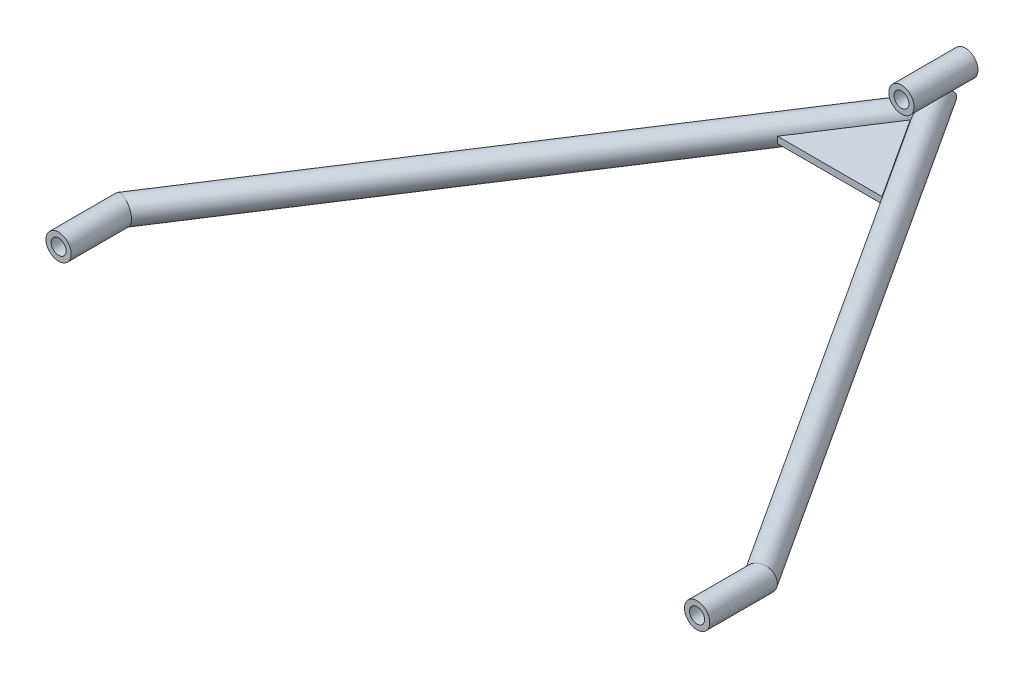
ISO-10303-21;
HEADER;
FILE_DESCRIPTION(('STEP AP214'),'2;1');
FILE_NAME('part.step','',(''),(''),'','','');
FILE_SCHEMA(('AUTOMOTIVE_DESIGN { 1 0 10303 214 1 1 1 1 }'));
ENDSEC;
DATA;
#1=APPLICATION_CONTEXT('core data for automotive mechanical design processes');
#2=APPLICATION_PROTOCOL_DEFINITION('international standard','automotive_design',2000,#1);
#3=PRODUCT_CONTEXT('',#1,'mechanical');
#4=PRODUCT('Part','Part','',(#3));
#5=PRODUCT_RELATED_PRODUCT_CATEGORY('part','',(#4));
#6=PRODUCT_DEFINITION_FORMATION('','',#4);
#7=PRODUCT_DEFINITION_CONTEXT('part definition',#1,'design');
#8=PRODUCT_DEFINITION('design','',#6,#7);
#9=PRODUCT_DEFINITION_SHAPE('','',#8);
#10=(LENGTH_UNIT() NAMED_UNIT(*) SI_UNIT(.MILLI.,.METRE.));
#11=(NAMED_UNIT(*) PLANE_ANGLE_UNIT() SI_UNIT($,.RADIAN.));
#12=(NAMED_UNIT(*) SI_UNIT($,.STERADIAN.) SOLID_ANGLE_UNIT());
#13=UNCERTAINTY_MEASURE_WITH_UNIT(LENGTH_MEASURE(1.E-05),#10,'distance_accuracy_value','');
#14=(GEOMETRIC_REPRESENTATION_CONTEXT(3) GLOBAL_UNCERTAINTY_ASSIGNED_CONTEXT((#13)) GLOBAL_UNIT_ASSIGNED_CONTEXT((#10,
#11,#12)) REPRESENTATION_CONTEXT('',''));
#15=CARTESIAN_POINT('',(0.,0.,0.));
#16=DIRECTION('',(0.,0.,1.));
#17=DIRECTION('',(1.,0.,0.));
#18=AXIS2_PLACEMENT_3D('',#15,#16,#17);
#19=CARTESIAN_POINT('',(0.,15.8,20.));
#20=DIRECTION('',(0.,0.,-1.));
#21=DIRECTION('',(-1.,0.,0.));
#22=AXIS2_PLACEMENT_3D('',#19,#20,#21);
#23=CYLINDRICAL_SURFACE('',#22,4.7);
#24=CARTESIAN_POINT('',(0.,15.8,20.));
#25=DIRECTION('',(0.,0.,1.));
#26=DIRECTION('',(1.,0.,0.));
#27=AXIS2_PLACEMENT_3D('',#24,#25,#26);
#28=CIRCLE('',#27,4.7);
#29=CARTESIAN_POINT('',(4.7,15.8,20.));
#30=VERTEX_POINT('',#29);
#31=EDGE_CURVE('E55',#30,#30,#28,.T.);
#32=ORIENTED_EDGE('',*,*,#31,.T.);
#33=EDGE_LOOP('',(#32));
#34=FACE_BOUND('',#33,.T.);
#35=CARTESIAN_POINT('',(0.,15.8,-20.));
#36=DIRECTION('',(0.,0.,1.));
#37=DIRECTION('',(1.,0.,0.));
#38=AXIS2_PLACEMENT_3D('',#35,#36,#37);
#39=CIRCLE('',#38,4.7);
#40=CARTESIAN_POINT('',(4.7,15.8,-20.));
#41=VERTEX_POINT('',#40);
#42=EDGE_CURVE('E61',#41,#41,#39,.T.);
#43=ORIENTED_EDGE('',*,*,#42,.F.);
#44=EDGE_LOOP('',(#43));
#45=FACE_BOUND('',#44,.T.);
#46=ADVANCED_FACE('F48',(#34,#45),#23,.F.);
#47=CARTESIAN_POINT('',(0.,15.8,20.));
#48=DIRECTION('',(0.,0.,-1.));
#49=DIRECTION('',(-1.,0.,0.));
#50=AXIS2_PLACEMENT_3D('',#47,#48,#49);
#51=CYLINDRICAL_SURFACE('',#50,7.9);
#52=CARTESIAN_POINT('',(0.,15.8,20.));
#53=DIRECTION('',(0.,0.,1.));
#54=DIRECTION('',(1.,0.,0.));
#55=AXIS2_PLACEMENT_3D('',#52,#53,#54);
#56=CIRCLE('',#55,7.9);
#57=CARTESIAN_POINT('',(7.9,15.8,20.));
#58=VERTEX_POINT('',#57);
#59=EDGE_CURVE('E11',#58,#58,#56,.T.);
#60=ORIENTED_EDGE('',*,*,#59,.F.);
#61=EDGE_LOOP('',(#60));
#62=FACE_BOUND('',#61,.T.);
#63=CARTESIAN_POINT('',(0.,15.8,-20.));
#64=DIRECTION('',(0.,0.,1.));
#65=DIRECTION('',(1.,0.,0.));
#66=AXIS2_PLACEMENT_3D('',#63,#64,#65);
#67=CIRCLE('',#66,7.9);
#68=CARTESIAN_POINT('',(7.9,15.8,-20.));
#69=VERTEX_POINT('',#68);
#70=EDGE_CURVE('E51',#69,#69,#67,.T.);
#71=ORIENTED_EDGE('',*,*,#70,.T.);
#72=EDGE_LOOP('',(#71));
#73=FACE_BOUND('',#72,.T.);
#74=ADVANCED_FACE('F68',(#62,#73),#51,.T.);
#75=CARTESIAN_POINT('',(0.,0.,20.));
#76=DIRECTION('',(0.,0.,1.));
#77=DIRECTION('',(1.,0.,0.));
#78=AXIS2_PLACEMENT_3D('',#75,#76,#77);
#79=PLANE('',#78);
#80=ORIENTED_EDGE('',*,*,#31,.F.);
#81=EDGE_LOOP('',(#80));
#82=FACE_BOUND('',#81,.T.);
#83=ORIENTED_EDGE('',*,*,#59,.T.);
#84=EDGE_LOOP('',(#83));
#85=FACE_BOUND('',#84,.T.);
#86=ADVANCED_FACE('F72',(#82,#85),#79,.T.);
#87=CARTESIAN_POINT('',(0.,0.,-20.));
#88=DIRECTION('',(0.,0.,1.));
#89=DIRECTION('',(1.,0.,0.));
#90=AXIS2_PLACEMENT_3D('',#87,#88,#89);
#91=PLANE('',#90);
#92=ORIENTED_EDGE('',*,*,#42,.T.);
#93=EDGE_LOOP('',(#92));
#94=FACE_BOUND('',#93,.T.);
#95=ORIENTED_EDGE('',*,*,#70,.F.);
#96=EDGE_LOOP('',(#95));
#97=FACE_BOUND('',#96,.T.);
#98=ADVANCED_FACE('F70',(#94,#97),#91,.F.);
#99=CLOSED_SHELL('',(#46,#74,#86,#98));
#100=MANIFOLD_SOLID_BREP('B2',#99);
#101=CARTESIAN_POINT('',(32.6783421009019,2.,64.8252539010611));
#102=DIRECTION('',(0.,0.,-1.));
#103=DIRECTION('',(-1.,0.,0.));
#104=AXIS2_PLACEMENT_3D('',#101,#102,#103);
#105=PLANE('',#104);
#106=DIRECTION('',(1.,0.,0.));
#107=VECTOR('',#106,1.);
#108=CARTESIAN_POINT('',(32.6783421009019,-2.,64.8252539010611));
#109=LINE('',#108,#107);
#110=CARTESIAN_POINT('',(-32.6783421009016,-2.,64.8252539010611));
#111=VERTEX_POINT('',#110);
#112=CARTESIAN_POINT('',(32.6783421009019,-2.,64.8252539010611));
#113=VERTEX_POINT('',#112);
#114=EDGE_CURVE('E164',#111,#113,#109,.T.);
#115=ORIENTED_EDGE('',*,*,#114,.T.);
#116=DIRECTION('',(0.,-1.,0.));
#117=VECTOR('',#116,1.);
#118=CARTESIAN_POINT('',(32.6783421009019,2.,64.8252539010611));
#119=LINE('',#118,#117);
#120=CARTESIAN_POINT('',(32.6783421009019,2.,64.8252539010611));
#121=VERTEX_POINT('',#120);
#122=EDGE_CURVE('E46',#121,#113,#119,.T.);
#123=ORIENTED_EDGE('',*,*,#122,.F.);
#124=DIRECTION('',(1.,0.,0.));
#125=VECTOR('',#124,1.);
#126=CARTESIAN_POINT('',(32.6783421009019,2.,64.8252539010611));
#127=LINE('',#126,#125);
#128=CARTESIAN_POINT('',(-32.6783421009016,2.,64.8252539010611));
#129=VERTEX_POINT('',#128);
#130=EDGE_CURVE('E157',#129,#121,#127,.T.);
#131=ORIENTED_EDGE('',*,*,#130,.F.);
#132=DIRECTION('',(0.,-1.,0.));
#133=VECTOR('',#132,1.);
#134=CARTESIAN_POINT('',(-32.6783421009016,2.,64.8252539010611));
#135=LINE('',#134,#133);
#136=EDGE_CURVE('E165',#129,#111,#135,.T.);
#137=ORIENTED_EDGE('',*,*,#136,.T.);
#138=EDGE_LOOP('',(#115,#123,#131,#137));
#139=FACE_BOUND('',#138,.T.);
#140=ADVANCED_FACE('F117',(#139),#105,.F.);
#141=CARTESIAN_POINT('',(1.38777878078145E-13,2.,14.5050198243357));
#142=DIRECTION('',(-0.838670567945423,0.,0.544639035015029));
#143=DIRECTION('',(0.544639035015029,0.,0.838670567945423));
#144=AXIS2_PLACEMENT_3D('',#141,#142,#143);
#145=PLANE('',#144);
#146=DIRECTION('',(-0.544639035015029,0.,-0.838670567945423));
#147=VECTOR('',#146,1.);
#148=CARTESIAN_POINT('',(1.38777878078145E-13,-2.,14.5050198243357));
#149=LINE('',#148,#147);
#150=CARTESIAN_POINT('',(1.38777878078145E-13,-2.,14.5050198243357));
#151=VERTEX_POINT('',#150);
#152=EDGE_CURVE('E145',#113,#151,#149,.T.);
#153=ORIENTED_EDGE('',*,*,#152,.T.);
#154=DIRECTION('',(0.,-1.,0.));
#155=VECTOR('',#154,1.);
#156=CARTESIAN_POINT('',(1.38777878078145E-13,2.,14.5050198243357));
#157=LINE('',#156,#155);
#158=CARTESIAN_POINT('',(1.38777878078145E-13,2.,14.5050198243357));
#159=VERTEX_POINT('',#158);
#160=EDGE_CURVE('E125',#159,#151,#157,.T.);
#161=ORIENTED_EDGE('',*,*,#160,.F.);
#162=DIRECTION('',(-0.544639035015029,0.,-0.838670567945423));
#163=VECTOR('',#162,1.);
#164=CARTESIAN_POINT('',(1.38777878078145E-13,2.,14.5050198243357));
#165=LINE('',#164,#163);
#166=EDGE_CURVE('E153',#121,#159,#165,.T.);
#167=ORIENTED_EDGE('',*,*,#166,.F.);
#168=ORIENTED_EDGE('',*,*,#122,.T.);
#169=EDGE_LOOP('',(#153,#161,#167,#168));
#170=FACE_BOUND('',#169,.T.);
#171=ADVANCED_FACE('F154',(#170),#145,.F.);
#172=CARTESIAN_POINT('',(-32.6783421009016,2.,64.8252539010611));
#173=DIRECTION('',(0.838670567945423,0.,0.54463903501503));
#174=DIRECTION('',(0.54463903501503,0.,-0.838670567945423));
#175=AXIS2_PLACEMENT_3D('',#172,#173,#174);
#176=PLANE('',#175);
#177=DIRECTION('',(-0.544639035015029,0.,0.838670567945423));
#178=VECTOR('',#177,1.);
#179=CARTESIAN_POINT('',(-32.6783421009016,-2.,64.8252539010611));
#180=LINE('',#179,#178);
#181=EDGE_CURVE('E150',#151,#111,#180,.T.);
#182=ORIENTED_EDGE('',*,*,#181,.T.);
#183=ORIENTED_EDGE('',*,*,#136,.F.);
#184=DIRECTION('',(-0.544639035015029,0.,0.838670567945423));
#185=VECTOR('',#184,1.);
#186=CARTESIAN_POINT('',(-32.6783421009016,2.,64.8252539010611));
#187=LINE('',#186,#185);
#188=EDGE_CURVE('E133',#159,#129,#187,.T.);
#189=ORIENTED_EDGE('',*,*,#188,.F.);
#190=ORIENTED_EDGE('',*,*,#160,.T.);
#191=EDGE_LOOP('',(#182,#183,#189,#190));
#192=FACE_BOUND('',#191,.T.);
#193=ADVANCED_FACE('F172',(#192),#176,.F.);
#194=CARTESIAN_POINT('',(0.,2.,0.));
#195=DIRECTION('',(0.,-1.,0.));
#196=DIRECTION('',(0.,0.,-1.));
#197=AXIS2_PLACEMENT_3D('',#194,#195,#196);
#198=PLANE('',#197);
#199=ORIENTED_EDGE('',*,*,#130,.T.);
#200=ORIENTED_EDGE('',*,*,#166,.T.);
#201=ORIENTED_EDGE('',*,*,#188,.T.);
#202=EDGE_LOOP('',(#199,#200,#201));
#203=FACE_BOUND('',#202,.T.);
#204=ADVANCED_FACE('F160',(#203),#198,.F.);
#205=CARTESIAN_POINT('',(0.,-2.,0.));
#206=DIRECTION('',(0.,-1.,0.));
#207=DIRECTION('',(0.,0.,-1.));
#208=AXIS2_PLACEMENT_3D('',#205,#206,#207);
#209=PLANE('',#208);
#210=ORIENTED_EDGE('',*,*,#114,.F.);
#211=ORIENTED_EDGE('',*,*,#181,.F.);
#212=ORIENTED_EDGE('',*,*,#152,.F.);
#213=EDGE_LOOP('',(#210,#211,#212));
#214=FACE_BOUND('',#213,.T.);
#215=ADVANCED_FACE('F173',(#214),#209,.T.);
#216=CLOSED_SHELL('',(#140,#171,#193,#204,#215));
#217=MANIFOLD_SOLID_BREP('B6',#216);
#218=CARTESIAN_POINT('',(417.574748146023,0.,643.008724443756));
#219=DIRECTION('',(-0.544639035015029,0.,-0.838670567945423));
#220=DIRECTION('',(-0.838670567945423,0.,0.544639035015029));
#221=AXIS2_PLACEMENT_3D('',#218,#219,#220);
#222=CYLINDRICAL_SURFACE('',#221,7.90000000000001);
#223=CARTESIAN_POINT('',(1.38777878078145E-13,0.,-1.11022302462516E-13));
#224=DIRECTION('',(-1.,0.,0.));
#225=DIRECTION('',(0.,0.,-1.));
#226=AXIS2_PLACEMENT_3D('',#223,#224,#225);
#227=ELLIPSE('',#226,14.5050198243356,7.90000000000001);
#228=CARTESIAN_POINT('',(1.32057322166214E-13,0.,-14.5050198243357));
#229=VERTEX_POINT('',#228);
#230=EDGE_CURVE('E212',#229,#229,#227,.F.);
#231=ORIENTED_EDGE('',*,*,#230,.T.);
#232=EDGE_LOOP('',(#231));
#233=FACE_BOUND('',#232,.T.);
#234=CARTESIAN_POINT('',(199.719134140011,0.,307.540497265586));
#235=DIRECTION('',(-0.284015344703924,0.,-0.958819734868193));
#236=DIRECTION('',(-0.958819734868193,0.,0.284015344703923));
#237=AXIS2_PLACEMENT_3D('',#234,#235,#236);
#238=ELLIPSE('',#237,8.23929641069184,7.9);
#239=CARTESIAN_POINT('',(191.819134140011,0.,309.880583875787));
#240=VERTEX_POINT('',#239);
#241=EDGE_CURVE('E257',#240,#240,#238,.F.);
#242=ORIENTED_EDGE('',*,*,#241,.F.);
#243=EDGE_LOOP('',(#242));
#244=FACE_BOUND('',#243,.T.);
#245=ADVANCED_FACE('F205',(#233,#244),#222,.T.);
#246=CARTESIAN_POINT('',(199.719134140011,0.,247.540497265587));
#247=DIRECTION('',(0.,0.,1.));
#248=DIRECTION('',(1.,0.,0.));
#249=AXIS2_PLACEMENT_3D('',#246,#247,#248);
#250=CYLINDRICAL_SURFACE('',#249,7.89999999999999);
#251=ORIENTED_EDGE('',*,*,#241,.T.);
#252=EDGE_LOOP('',(#251));
#253=FACE_BOUND('',#252,.T.);
#254=CARTESIAN_POINT('',(199.719134140011,0.,347.540497265587));
#255=DIRECTION('',(0.,0.,1.));
#256=DIRECTION('',(1.,0.,0.));
#257=AXIS2_PLACEMENT_3D('',#254,#255,#256);
#258=CIRCLE('',#257,7.89999999999999);
#259=CARTESIAN_POINT('',(207.619134140011,0.,347.540497265587));
#260=VERTEX_POINT('',#259);
#261=EDGE_CURVE('E261',#260,#260,#258,.T.);
#262=ORIENTED_EDGE('',*,*,#261,.F.);
#263=EDGE_LOOP('',(#262));
#264=FACE_BOUND('',#263,.T.);
#265=ADVANCED_FACE('F271',(#253,#264),#250,.T.);
#266=CARTESIAN_POINT('',(417.574748146023,0.,643.008724443756));
#267=DIRECTION('',(-0.544639035015029,0.,-0.838670567945423));
#268=DIRECTION('',(-0.838670567945423,0.,0.544639035015029));
#269=AXIS2_PLACEMENT_3D('',#266,#267,#268);
#270=CYLINDRICAL_SURFACE('',#269,7.90000000000001);
#271=CARTESIAN_POINT('',(204.419134140011,0.,329.282882419851));
#272=CARTESIAN_POINT('',(204.419127524465,-0.106174699086426,329.282864623147));
#273=CARTESIAN_POINT('',(204.415486469497,-0.21250239209016,329.273277904309));
#274=CARTESIAN_POINT('',(204.401371224728,-0.421580430201829,329.236146883493));
#275=CARTESIAN_POINT('',(204.390879194261,-0.524320695323313,329.208555696098));
#276=CARTESIAN_POINT('',(204.36078885634,-0.748956660482788,329.129540734513));
#277=CARTESIAN_POINT('',(204.339556352983,-0.86910597597539,329.073848481307));
#278=CARTESIAN_POINT('',(204.290497954321,-1.09839750899542,328.945492522912));
#279=CARTESIAN_POINT('',(204.262659194113,-1.20751764974777,328.872795707349));
#280=CARTESIAN_POINT('',(204.206364162889,-1.4012522774952,328.726226010379));
#281=CARTESIAN_POINT('',(204.178497339469,-1.48718708956856,328.653833529221));
#282=CARTESIAN_POINT('',(204.120062842447,-1.65211656534198,328.502462183585));
#283=CARTESIAN_POINT('',(204.089493019876,-1.73110560560773,328.423478081415));
#284=CARTESIAN_POINT('',(204.026197769494,-1.88308014164717,328.260447362518));
#285=CARTESIAN_POINT('',(203.993467795339,-1.95605219814463,328.176390102593));
#286=CARTESIAN_POINT('',(203.926334520041,-2.09654948707933,328.004555890067));
#287=CARTESIAN_POINT('',(203.891931714667,-2.1640763177103,327.916780040509));
#288=CARTESIAN_POINT('',(203.807869768778,-2.32011055682079,327.703072602981));
#289=CARTESIAN_POINT('',(203.757551496055,-2.40637098775657,327.575763214454));
#290=CARTESIAN_POINT('',(203.654722336458,-2.57110181051665,327.317021963118));
#291=CARTESIAN_POINT('',(203.602210477284,-2.64956869469635,327.185588278791));
#292=CARTESIAN_POINT('',(203.495258933508,-2.79989348593079,326.919480509153));
#293=CARTESIAN_POINT('',(203.440816431917,-2.87174113499725,326.784801789216));
#294=CARTESIAN_POINT('',(203.330284256799,-3.00954859301572,326.513116737385));
#295=CARTESIAN_POINT('',(203.274194307302,-3.07550740794198,326.376110017156));
#296=CARTESIAN_POINT('',(203.103038418812,-3.26628043458667,325.960913098138));
#297=CARTESIAN_POINT('',(202.98567697281,-3.3831816115225,325.680020113048));
#298=CARTESIAN_POINT('',(202.745485059359,-3.59961785328968,325.114347414277));
#299=CARTESIAN_POINT('',(202.622659356703,-3.69916768972633,324.829571231386));
#300=CARTESIAN_POINT('',(202.402837420135,-3.86022508769734,324.329309838911));
#301=CARTESIAN_POINT('',(202.307074748434,-3.92501662102927,324.114329825641));
#302=CARTESIAN_POINT('',(202.112219893687,-4.04676965192322,323.683643802073));
#303=CARTESIAN_POINT('',(202.013127471575,-4.1037305857684,323.467937740653));
#304=CARTESIAN_POINT('',(201.811289612876,-4.2102154491479,323.036151241497));
#305=CARTESIAN_POINT('',(201.70854094559,-4.2597325887746,322.820070641647));
#306=CARTESIAN_POINT('',(201.499149599848,-4.35139136718753,322.388240110063));
#307=CARTESIAN_POINT('',(201.392507072668,-4.3935332921308,322.172490165822));
#308=CARTESIAN_POINT('',(201.175530628857,-4.47013094987583,321.743064769934));
#309=CARTESIAN_POINT('',(201.065221326063,-4.50462928342458,321.529384511979));
#310=CARTESIAN_POINT('',(200.839831913896,-4.56592593454523,321.103406000787));
#311=CARTESIAN_POINT('',(200.724751413856,-4.59272362015554,320.891107862372));
#312=CARTESIAN_POINT('',(200.48937817414,-4.63800314578622,320.468819095624));
#313=CARTESIAN_POINT('',(200.369091330292,-4.65649413573252,320.25882617813));
#314=CARTESIAN_POINT('',(200.122559532434,-4.68429732599902,319.841784063328));
#315=CARTESIAN_POINT('',(199.996316070355,-4.6936118120699,319.634734145626));
#316=CARTESIAN_POINT('',(199.768348696735,-4.70077193940899,319.273969928467));
#317=CARTESIAN_POINT('',(199.668034221077,-4.70083794113804,319.119409898087));
#318=CARTESIAN_POINT('',(199.463271049549,-4.69414868545271,318.813187110764));
#319=CARTESIAN_POINT('',(199.358822471996,-4.68739362312324,318.661524271085));
#320=CARTESIAN_POINT('',(199.145409491384,-4.66608573924579,318.361635420119));
#321=CARTESIAN_POINT('',(199.036439208105,-4.65152245041246,318.213414301536));
#322=CARTESIAN_POINT('',(198.813988130506,-4.61339855007763,317.921543684676));
#323=CARTESIAN_POINT('',(198.700507264009,-4.58983779455286,317.777894259616));
#324=CARTESIAN_POINT('',(198.467534580861,-4.5318985880932,317.494372883089));
#325=CARTESIAN_POINT('',(198.347981639576,-4.4973760977436,317.354579841152));
#326=CARTESIAN_POINT('',(198.1047742623,-4.41591262409657,317.082268337677));
#327=CARTESIAN_POINT('',(197.981119408905,-4.36897037356815,316.949750620132));
#328=CARTESIAN_POINT('',(197.731108066145,-4.26101340948037,316.694014639855));
#329=CARTESIAN_POINT('',(197.604760547264,-4.20004030243956,316.570770284476));
#330=CARTESIAN_POINT('',(197.350797591071,-4.06224206176358,316.334919897619));
#331=CARTESIAN_POINT('',(197.223182960731,-3.98542646953695,316.222307522086));
#332=CARTESIAN_POINT('',(197.010574064063,-3.84244251283419,316.043942705242));
#333=CARTESIAN_POINT('',(196.925215669859,-3.78093542680625,315.974860820726));
#334=CARTESIAN_POINT('',(196.756084326853,-3.64990007076356,315.842638147537));
#335=CARTESIAN_POINT('',(196.672310958883,-3.58037395693322,315.77949577008));
#336=CARTESIAN_POINT('',(196.507436701655,-3.43324990350134,315.659428497283));
#337=CARTESIAN_POINT('',(196.426335683833,-3.35565235295901,315.602503302533));
#338=CARTESIAN_POINT('',(196.267957228385,-3.19253794965168,315.495007158582));
#339=CARTESIAN_POINT('',(196.190679920126,-3.1070208292287,315.444436424279));
#340=CARTESIAN_POINT('',(196.040862675341,-2.92813493083053,315.349496506055));
#341=CARTESIAN_POINT('',(195.968339253971,-2.83474111774179,315.305148388128));
#342=CARTESIAN_POINT('',(195.829416645062,-2.64089314287239,315.222722010015));
#343=CARTESIAN_POINT('',(195.763017540877,-2.54043888503177,315.184643835157));
#344=CARTESIAN_POINT('',(195.637326499942,-2.33314028495821,315.11451787365));
#345=CARTESIAN_POINT('',(195.578036452912,-2.22629425493728,315.08247168913));
#346=CARTESIAN_POINT('',(195.467446760501,-2.00704471398071,315.024129856158));
#347=CARTESIAN_POINT('',(195.416146853391,-1.89464138524139,314.997834019333));
#348=CARTESIAN_POINT('',(195.324747293454,-1.67127032608742,314.951933562304));
#349=CARTESIAN_POINT('',(195.284196974132,-1.56054435759815,314.932047390182));
#350=CARTESIAN_POINT('',(195.211361194585,-1.33564898306985,314.896886104742));
#351=CARTESIAN_POINT('',(195.179078657002,-1.22147837525651,314.881612621659));
#352=CARTESIAN_POINT('',(195.123177455292,-0.990597951416117,314.855471424758));
#353=CARTESIAN_POINT('',(195.09955488189,-0.873889306375819,314.844601722754));
#354=CARTESIAN_POINT('',(195.061203725466,-0.638662932631462,314.827083812413));
#355=CARTESIAN_POINT('',(195.046478457213,-0.520144546531616,314.820437177369));
#356=CARTESIAN_POINT('',(195.026053649319,-0.281719616457141,314.81124402807));
#357=CARTESIAN_POINT('',(195.020388671899,-0.161809506127685,314.80871321379));
#358=CARTESIAN_POINT('',(195.018251870124,0.0781531313151259,314.807756904038));
#359=CARTESIAN_POINT('',(195.021783440552,0.198205694663389,314.80933292455));
#360=CARTESIAN_POINT('',(195.038007067278,0.437525913924101,314.816619506105));
#361=CARTESIAN_POINT('',(195.050696206948,0.556793807547184,314.822328750744));
#362=CARTESIAN_POINT('',(195.085102620526,0.79378461896832,314.837979484946));
#363=CARTESIAN_POINT('',(195.106823217201,0.911506951677757,314.847922532202));
#364=CARTESIAN_POINT('',(195.15916664468,1.14502140311159,314.872253073249));
#365=CARTESIAN_POINT('',(195.189827027715,1.26080315504381,314.886659331389));
#366=CARTESIAN_POINT('',(195.25966322482,1.48908221939533,314.920118886647));
#367=CARTESIAN_POINT('',(195.298839095922,1.60157950981114,314.93917221489));
#368=CARTESIAN_POINT('',(195.385229117989,1.82245045580441,314.982177254016));
#369=CARTESIAN_POINT('',(195.432441629343,1.93082494699505,315.006127965951));
#370=CARTESIAN_POINT('',(195.534319981412,2.14269622670141,315.059203569976));
#371=CARTESIAN_POINT('',(195.588985897837,2.24619296565499,315.088328514625));
#372=CARTESIAN_POINT('',(195.70455351775,2.44671580457485,315.151740633426));
#373=CARTESIAN_POINT('',(195.765397420535,2.54378998224174,315.185981155859));
#374=CARTESIAN_POINT('',(195.892914532346,2.73184074302223,315.260034278012));
#375=CARTESIAN_POINT('',(195.959589688489,2.82281527134708,315.299848741616));
#376=CARTESIAN_POINT('',(196.097800969273,2.99806486218674,315.385162018199));
#377=CARTESIAN_POINT('',(196.169334241177,3.08234379440353,315.430657508158));
#378=CARTESIAN_POINT('',(196.316346111118,3.24391269036037,315.527414520537));
#379=CARTESIAN_POINT('',(196.391826125985,3.32120011667731,315.578678121349));
#380=CARTESIAN_POINT('',(196.546329075472,3.46912613972382,315.687333456424));
#381=CARTESIAN_POINT('',(196.625375572449,3.53970643137788,315.744771047953));
#382=CARTESIAN_POINT('',(196.785455591104,3.67347607145728,315.865241142318));
#383=CARTESIAN_POINT('',(196.866489866378,3.73666256271152,315.928275791574));
#384=CARTESIAN_POINT('',(197.111143887579,3.91523912523027,316.125372572946));
#385=CARTESIAN_POINT('',(197.276399751341,4.01972554461155,316.267486339322));
#386=CARTESIAN_POINT('',(197.56339258289,4.17882363410446,316.531402304736));
#387=CARTESIAN_POINT('',(197.685591730508,4.2393677165979,316.649285104185));
#388=CARTESIAN_POINT('',(197.927411905995,4.34709549039249,316.893606378269));
#389=CARTESIAN_POINT('',(198.047031697633,4.39427290128498,317.020048840259));
#390=CARTESIAN_POINT('',(198.28281411068,4.47690006791736,317.280184378709));
#391=CARTESIAN_POINT('',(198.398969691008,4.512327247163,317.413890845163));
#392=CARTESIAN_POINT('',(198.627153358517,4.57291107603005,317.687081041502));
#393=CARTESIAN_POINT('',(198.739179750578,4.59806354946399,317.826567095198));
#394=CARTESIAN_POINT('',(198.947110931506,4.63723388609183,318.094921685415));
#395=CARTESIAN_POINT('',(199.043455208543,4.65215731581802,318.223322154583));
#396=CARTESIAN_POINT('',(199.232768124882,4.67573909965797,318.48316521455));
#397=CARTESIAN_POINT('',(199.325736147244,4.68439631416954,318.61460835422));
#398=CARTESIAN_POINT('',(199.599870551955,4.70206577507958,319.012817032966));
#399=CARTESIAN_POINT('',(199.776164828906,4.70275807118343,319.283328115575));
#400=CARTESIAN_POINT('',(200.117881927376,4.68618575106389,319.831989234412));
#401=CARTESIAN_POINT('',(200.283255856264,4.66884552520967,320.110166635698));
#402=CARTESIAN_POINT('',(200.60394596792,4.61881250040625,320.670736454181));
#403=CARTESIAN_POINT('',(200.759265596023,4.58612499258038,320.953127386262));
#404=CARTESIAN_POINT('',(201.023637990715,4.5168538059869,321.449728421862));
#405=CARTESIAN_POINT('',(201.134567190235,4.48327603319172,321.66337431407));
#406=CARTESIAN_POINT('',(201.352109061338,4.40869837298419,322.091587594415));
#407=CARTESIAN_POINT('',(201.458721418095,4.3676979454257,322.306155048503));
#408=CARTESIAN_POINT('',(201.668125313796,4.27836410671546,322.735847575331));
#409=CARTESIAN_POINT('',(201.770913656617,4.23002472578672,322.950972960597));
#410=CARTESIAN_POINT('',(201.972910160366,4.12594269385631,323.381103263825));
#411=CARTESIAN_POINT('',(202.072118475612,4.07020036244634,323.596108186584));
#412=CARTESIAN_POINT('',(202.266713606255,3.95130041670152,324.024398551754));
#413=CARTESIAN_POINT('',(202.362117286016,3.88818194272846,324.237687178741));
#414=CARTESIAN_POINT('',(202.549801070141,3.75375203010409,324.663092057262));
#415=CARTESIAN_POINT('',(202.642080859594,3.6824397686284,324.875208188808));
#416=CARTESIAN_POINT('',(202.823454006752,3.53088522826176,325.297285632383));
#417=CARTESIAN_POINT('',(202.912551009952,3.45065362899057,325.507249199545));
#418=CARTESIAN_POINT('',(203.087585647284,3.2800137529429,325.92430599961));
#419=CARTESIAN_POINT('',(203.173524192283,3.18960844119667,326.131400049146));
#420=CARTESIAN_POINT('',(203.301222322626,3.04351608543639,326.442173483111));
#421=CARTESIAN_POINT('',(203.344235996899,2.99219920144685,326.547400235081));
#422=CARTESIAN_POINT('',(203.429290328577,2.88606494819919,326.756480712723));
#423=CARTESIAN_POINT('',(203.471330985691,2.83124757788576,326.860334437982));
#424=CARTESIAN_POINT('',(203.55441268968,2.71764574761806,327.06650713833));
#425=CARTESIAN_POINT('',(203.595452031417,2.65885508687977,327.16882339502));
#426=CARTESIAN_POINT('',(203.67632830068,2.53692097952266,327.371320481946));
#427=CARTESIAN_POINT('',(203.716165275588,2.47377770475304,327.471501396284));
#428=CARTESIAN_POINT('',(203.794759887423,2.34205153278599,327.669937910426));
#429=CARTESIAN_POINT('',(203.833506587564,2.27342980178443,327.768172204379));
#430=CARTESIAN_POINT('',(203.909310298631,2.13048578021322,327.961073012954));
#431=CARTESIAN_POINT('',(203.946367683512,2.05616476113223,328.055740316369));
#432=CARTESIAN_POINT('',(204.018332823009,1.90110115125881,328.24021061963));
#433=CARTESIAN_POINT('',(204.053244838028,1.82037206866184,328.330023214511));
#434=CARTESIAN_POINT('',(204.120395896187,1.6514096217641,328.503300879781));
#435=CARTESIAN_POINT('',(204.152637168786,1.56318264373731,328.586771239574));
#436=CARTESIAN_POINT('',(204.213793927432,1.37755010680495,328.745523457635));
#437=CARTESIAN_POINT('',(204.24268974316,1.28009583729133,328.820756756485));
#438=CARTESIAN_POINT('',(204.295647882345,1.07548009407588,328.958941206679));
#439=CARTESIAN_POINT('',(204.31971316473,0.96832462155082,329.021899876125));
#440=CARTESIAN_POINT('',(204.358033235904,0.761516814022981,329.122309549714));
#441=CARTESIAN_POINT('',(204.373227059596,0.663239211757531,329.162192931359));
#442=CARTESIAN_POINT('',(204.397566103392,0.461029345916113,329.226134205417));
#443=CARTESIAN_POINT('',(204.406729031367,0.357114615414465,329.250238427343));
#444=CARTESIAN_POINT('',(204.414620470736,0.210156338035535,329.271002715915));
#445=CARTESIAN_POINT('',(204.416308383484,0.168277011512126,329.275444909559));
#446=CARTESIAN_POINT('',(204.418566645554,0.0842731922972851,329.28138859479));
#447=CARTESIAN_POINT('',(204.419136766214,0.0421486512108043,329.282889484689));
#448=CARTESIAN_POINT('',(204.419134140011,0.,329.282882419851));
#449=B_SPLINE_CURVE_WITH_KNOTS('',3,(#271,#272,#273,#274,#275,#276,#277,#278,#279,#280,#281,
#282,#283,#284,#285,#286,#287,#288,#289,#290,#291,#292,#293,#294,#295,#296,#297,#298,#299,#300,
#301,#302,#303,#304,#305,#306,#307,#308,#309,#310,#311,#312,#313,#314,#315,#316,#317,#318,#319,
#320,#321,#322,#323,#324,#325,#326,#327,#328,#329,#330,#331,#332,#333,#334,#335,#336,#337,#338,
#339,#340,#341,#342,#343,#344,#345,#346,#347,#348,#349,#350,#351,#352,#353,#354,#355,#356,#357,
#358,#359,#360,#361,#362,#363,#364,#365,#366,#367,#368,#369,#370,#371,#372,#373,#374,#375,#376,
#377,#378,#379,#380,#381,#382,#383,#384,#385,#386,#387,#388,#389,#390,#391,#392,#393,#394,#395,
#396,#397,#398,#399,#400,#401,#402,#403,#404,#405,#406,#407,#408,#409,#410,#411,#412,#413,#414,
#415,#416,#417,#418,#419,#420,#421,#422,#423,#424,#425,#426,#427,#428,#429,#430,#431,#432,#433,
#434,#435,#436,#437,#438,#439,#440,#441,#442,#443,#444,#445,#446,#447,#448),.UNSPECIFIED.,.T.,
.F.,(4,2,2,2,2,2,2,2,2,2,2,2,2,2,2,2,2,2,2,2,2,2,2,2,2,2,2,2,2,2,2,2,2,2,2,2,2,2,2,2,2,2,2,2,2,
2,2,2,2,2,2,2,2,2,2,2,2,2,2,2,2,2,2,2,2,2,2,2,2,2,2,2,2,2,2,2,2,2,2,2,2,2,2,2,2,2,2,2,4),(0.,
0.318332098807433,0.637496491959975,1.03756873600911,1.4384265610387,1.78523158446829,
2.13231485144473,2.48015345648861,2.82788959519637,3.31296466088245,3.79825706450724,
4.28428931324838,4.77040344895056,5.74796560858885,6.72469143794255,7.45684320417255,
8.18904764968867,8.92191597992151,9.65475586868598,10.3834024337443,11.1121087788661,
11.8400104650382,12.5677307942601,13.1203452877446,13.672943976701,14.2262853084927,
14.7796354980418,15.340580681026,15.9015831212709,16.4609429501931,17.0199668737149,
17.3971944983949,17.7743209282108,18.1514291882039,18.5285501979926,18.9069186015433,
19.2852921539331,19.6637660630905,20.0422275721798,20.400554664344,20.7590082500498,
21.1172998229901,21.4757247984115,21.8355138214141,22.1954356746277,22.5552429455581,
22.9151827105754,23.2766567641168,23.6381332387148,23.9995360542551,24.3609425411659,
24.71923439391,25.0776463442167,25.435849621138,25.7941823833233,26.1553894423128,
26.516735624053,27.239041491384,27.7791417029975,28.3194952645963,28.8608811086469,
29.4024867823043,29.8859393936852,30.3694799058631,31.3370672452968,32.3087280606143,
33.2800541322069,34.0090821427292,34.7381632259163,35.4678405801058,36.1974864437334,
36.9234227614423,37.6494320418693,38.3745812079026,39.0995195808749,39.4736452565796,
39.847771045074,40.2224948204303,40.5972038094672,40.974856270284,41.3524247220798,
41.7292173826202,42.1056922691371,42.4842789709324,42.8626330581651,43.1828853596544,
43.5021930934264,43.6285369857131,43.7549067208504),.UNSPECIFIED.);
#450=CARTESIAN_POINT('',(204.419134140011,0.,329.282882419851));
#451=VERTEX_POINT('',#450);
#452=EDGE_CURVE('E216',#451,#451,#449,.T.);
#453=ORIENTED_EDGE('',*,*,#452,.F.);
#454=EDGE_LOOP('',(#453));
#455=FACE_BOUND('',#454,.T.);
#456=ADVANCED_FACE('F228',(#455),#270,.T.);
#457=CARTESIAN_POINT('',(199.719134140011,0.,347.540497265587));
#458=DIRECTION('',(0.,0.,1.));
#459=DIRECTION('',(1.,0.,0.));
#460=AXIS2_PLACEMENT_3D('',#457,#458,#459);
#461=PLANE('',#460);
#462=CARTESIAN_POINT('',(199.719134140011,0.,347.540497265587));
#463=DIRECTION('',(0.,0.,1.));
#464=DIRECTION('',(1.,0.,0.));
#465=AXIS2_PLACEMENT_3D('',#462,#463,#464);
#466=CIRCLE('',#465,4.70000000000001);
#467=CARTESIAN_POINT('',(204.419134140011,0.,347.540497265587));
#468=VERTEX_POINT('',#467);
#469=EDGE_CURVE('E220',#468,#468,#466,.T.);
#470=ORIENTED_EDGE('',*,*,#469,.F.);
#471=EDGE_LOOP('',(#470));
#472=FACE_BOUND('',#471,.T.);
#473=ORIENTED_EDGE('',*,*,#261,.T.);
#474=EDGE_LOOP('',(#473));
#475=FACE_BOUND('',#474,.T.);
#476=ADVANCED_FACE('F237',(#472,#475),#461,.T.);
#477=CARTESIAN_POINT('',(199.719134140011,0.,247.540497265587));
#478=DIRECTION('',(0.,0.,1.));
#479=DIRECTION('',(1.,0.,0.));
#480=AXIS2_PLACEMENT_3D('',#477,#478,#479);
#481=CYLINDRICAL_SURFACE('',#480,4.70000000000001);
#482=ORIENTED_EDGE('',*,*,#469,.T.);
#483=EDGE_LOOP('',(#482));
#484=FACE_BOUND('',#483,.T.);
#485=ORIENTED_EDGE('',*,*,#452,.T.);
#486=EDGE_LOOP('',(#485));
#487=FACE_BOUND('',#486,.T.);
#488=ADVANCED_FACE('F233',(#484,#487),#481,.F.);
#489=CARTESIAN_POINT('',(-417.574748146022,0.,643.008724443756));
#490=DIRECTION('',(0.544639035015028,0.,-0.838670567945424));
#491=DIRECTION('',(-0.838670567945424,0.,-0.544639035015028));
#492=AXIS2_PLACEMENT_3D('',#489,#490,#491);
#493=CYLINDRICAL_SURFACE('',#492,7.90000000000001);
#494=CARTESIAN_POINT('',(-199.719134140011,0.,307.540497265587));
#495=DIRECTION('',(0.284015344703923,0.,-0.958819734868193));
#496=DIRECTION('',(0.958819734868193,0.,0.284015344703923));
#497=AXIS2_PLACEMENT_3D('',#494,#495,#496);
#498=ELLIPSE('',#497,8.23929641069183,7.9);
#499=CARTESIAN_POINT('',(-191.819134140011,0.,309.880583875787));
#500=VERTEX_POINT('',#499);
#501=EDGE_CURVE('E116',#500,#500,#498,.F.);
#502=ORIENTED_EDGE('',*,*,#501,.F.);
#503=EDGE_LOOP('',(#502));
#504=FACE_BOUND('',#503,.T.);
#505=ORIENTED_EDGE('',*,*,#230,.F.);
#506=EDGE_LOOP('',(#505));
#507=FACE_BOUND('',#506,.T.);
#508=ADVANCED_FACE('F236',(#504,#507),#493,.T.);
#509=CARTESIAN_POINT('',(-199.719134140011,0.,247.540497265587));
#510=DIRECTION('',(0.,0.,1.));
#511=DIRECTION('',(1.,0.,0.));
#512=AXIS2_PLACEMENT_3D('',#509,#510,#511);
#513=CYLINDRICAL_SURFACE('',#512,7.89999999999999);
#514=ORIENTED_EDGE('',*,*,#501,.T.);
#515=EDGE_LOOP('',(#514));
#516=FACE_BOUND('',#515,.T.);
#517=CARTESIAN_POINT('',(-199.719134140011,0.,347.540497265587));
#518=DIRECTION('',(0.,0.,1.));
#519=DIRECTION('',(1.,0.,0.));
#520=AXIS2_PLACEMENT_3D('',#517,#518,#519);
#521=CIRCLE('',#520,7.89999999999999);
#522=CARTESIAN_POINT('',(-191.819134140011,0.,347.540497265587));
#523=VERTEX_POINT('',#522);
#524=EDGE_CURVE('E300',#523,#523,#521,.T.);
#525=ORIENTED_EDGE('',*,*,#524,.F.);
#526=EDGE_LOOP('',(#525));
#527=FACE_BOUND('',#526,.T.);
#528=ADVANCED_FACE('F207',(#516,#527),#513,.T.);
#529=CARTESIAN_POINT('',(-199.719134140011,0.,347.540497265587));
#530=DIRECTION('',(0.,0.,1.));
#531=DIRECTION('',(1.,0.,0.));
#532=AXIS2_PLACEMENT_3D('',#529,#530,#531);
#533=PLANE('',#532);
#534=CARTESIAN_POINT('',(-199.719134140011,0.,347.540497265587));
#535=DIRECTION('',(0.,0.,1.));
#536=DIRECTION('',(1.,0.,0.));
#537=AXIS2_PLACEMENT_3D('',#534,#535,#536);
#538=CIRCLE('',#537,4.70000000000001);
#539=CARTESIAN_POINT('',(-195.019134140011,0.,347.540497265587));
#540=VERTEX_POINT('',#539);
#541=EDGE_CURVE('E258',#540,#540,#538,.T.);
#542=ORIENTED_EDGE('',*,*,#541,.F.);
#543=EDGE_LOOP('',(#542));
#544=FACE_BOUND('',#543,.T.);
#545=ORIENTED_EDGE('',*,*,#524,.T.);
#546=EDGE_LOOP('',(#545));
#547=FACE_BOUND('',#546,.T.);
#548=ADVANCED_FACE('F283',(#544,#547),#533,.T.);
#549=CARTESIAN_POINT('',(-199.719134140011,0.,247.540497265587));
#550=DIRECTION('',(0.,0.,1.));
#551=DIRECTION('',(1.,0.,0.));
#552=AXIS2_PLACEMENT_3D('',#549,#550,#551);
#553=CYLINDRICAL_SURFACE('',#552,4.70000000000001);
#554=ORIENTED_EDGE('',*,*,#541,.T.);
#555=EDGE_LOOP('',(#554));
#556=FACE_BOUND('',#555,.T.);
#557=CARTESIAN_POINT('',(-195.019134140011,0.,314.808151759994));
#558=CARTESIAN_POINT('',(-195.019134951068,-0.119829811364878,314.808151500914));
#559=CARTESIAN_POINT('',(-195.023722314904,-0.239687172226194,314.810200132166));
#560=CARTESIAN_POINT('',(-195.04203023816,-0.478608697976001,314.818431383277));
#561=CARTESIAN_POINT('',(-195.055755619291,-0.597672410575796,314.82461618561));
#562=CARTESIAN_POINT('',(-195.092230289319,-0.834337889175132,314.841241314018));
#563=CARTESIAN_POINT('',(-195.114996078394,-0.951936574228477,314.851689422268));
#564=CARTESIAN_POINT('',(-195.169311018231,-1.18464823689329,314.877013553524));
#565=CARTESIAN_POINT('',(-195.200863448325,-1.29976026912334,314.891891229869));
#566=CARTESIAN_POINT('',(-195.272366703734,-1.52656090332805,314.926283241259));
#567=CARTESIAN_POINT('',(-195.312312649985,-1.63825145114696,314.945794883482));
#568=CARTESIAN_POINT('',(-195.400137737655,-1.85747481230524,314.98971569401));
#569=CARTESIAN_POINT('',(-195.448016920158,-1.965007604109,315.014124887678));
#570=CARTESIAN_POINT('',(-195.55106878811,-2.1750645608498,315.068089973289));
#571=CARTESIAN_POINT('',(-195.60623566553,-2.27759262617993,315.097641772652));
#572=CARTESIAN_POINT('',(-195.723173032929,-2.47702579031924,315.162162774545));
#573=CARTESIAN_POINT('',(-195.784943604698,-2.5739308194626,315.197132044176));
#574=CARTESIAN_POINT('',(-195.913807104332,-2.76084831200062,315.272440745499));
#575=CARTESIAN_POINT('',(-195.980860473198,-2.8509036249032,315.31274155881));
#576=CARTESIAN_POINT('',(-196.119765843619,-3.02438448911732,315.399044246703));
#577=CARTESIAN_POINT('',(-196.191619437169,-3.10780782064238,315.445048017042));
#578=CARTESIAN_POINT('',(-196.339109500021,-3.2676059095252,315.542772372704));
#579=CARTESIAN_POINT('',(-196.414744659298,-3.34398308210622,315.594490985682));
#580=CARTESIAN_POINT('',(-196.568838431677,-3.48954010323609,315.703575709031));
#581=CARTESIAN_POINT('',(-196.647298076021,-3.55871728639446,315.760943895652));
#582=CARTESIAN_POINT('',(-196.889693381538,-3.75883628494659,315.944504325771));
#583=CARTESIAN_POINT('',(-197.05667738049,-3.8781528574247,316.07958326449));
#584=CARTESIAN_POINT('',(-197.39105997985,-4.08768679119977,316.369915990472));
#585=CARTESIAN_POINT('',(-197.558458741366,-4.17789009150108,316.525179475745));
#586=CARTESIAN_POINT('',(-197.858833416748,-4.31874734077864,316.822347239091));
#587=CARTESIAN_POINT('',(-197.992548218012,-4.37360653613147,316.961570684314));
#588=CARTESIAN_POINT('',(-198.255618463579,-4.46852283546989,317.248983791319));
#589=CARTESIAN_POINT('',(-198.384971241224,-4.50857102889608,317.397178788368));
#590=CARTESIAN_POINT('',(-198.638807691438,-4.57604460957761,317.70098697327));
#591=CARTESIAN_POINT('',(-198.763279044331,-4.60343973121116,317.856616975146));
#592=CARTESIAN_POINT('',(-199.006911345868,-4.64737191728157,318.173518660456));
#593=CARTESIAN_POINT('',(-199.126070050519,-4.66390443325148,318.334792677459));
#594=CARTESIAN_POINT('',(-199.353337053955,-4.68706450497718,318.653525202977));
#595=CARTESIAN_POINT('',(-199.461699975564,-4.69414598419715,318.810771291811));
#596=CARTESIAN_POINT('',(-199.673964904893,-4.70098207156522,319.128346876554));
#597=CARTESIAN_POINT('',(-199.777867600127,-4.70073781301531,319.288675891693));
#598=CARTESIAN_POINT('',(-199.981647416371,-4.69377125027918,319.611927754612));
#599=CARTESIAN_POINT('',(-200.081520670776,-4.68704287113132,319.774852893907));
#600=CARTESIAN_POINT('',(-200.27748806882,-4.6677546684126,320.102634603461));
#601=CARTESIAN_POINT('',(-200.373581754817,-4.6551941410105,320.267491404494));
#602=CARTESIAN_POINT('',(-200.562683183855,-4.6246768802997,320.599344494918));
#603=CARTESIAN_POINT('',(-200.6556770489,-4.60669876763299,320.766346703857));
#604=CARTESIAN_POINT('',(-200.838480750144,-4.56572284737787,321.101479311249));
#605=CARTESIAN_POINT('',(-200.928290313018,-4.54272461009018,321.269609805083));
#606=CARTESIAN_POINT('',(-201.193261356022,-4.46663232051334,321.775016479666));
#607=CARTESIAN_POINT('',(-201.364090617719,-4.40641954782854,322.113530192838));
#608=CARTESIAN_POINT('',(-201.625333621897,-4.29732773150144,322.647371186364));
#609=CARTESIAN_POINT('',(-201.719050674178,-4.25451839139377,322.84237017706));
#610=CARTESIAN_POINT('',(-201.903499328658,-4.16283193188617,323.232372193827));
#611=CARTESIAN_POINT('',(-201.994230856026,-4.11395466054068,323.427375219877));
#612=CARTESIAN_POINT('',(-202.172983188433,-4.0099035353631,323.81715925498));
#613=CARTESIAN_POINT('',(-202.261001571517,-3.95472425143246,324.011939924269));
#614=CARTESIAN_POINT('',(-202.434386221832,-3.83775253215623,324.400691580557));
#615=CARTESIAN_POINT('',(-202.519752582393,-3.77596032987616,324.594662595842));
#616=CARTESIAN_POINT('',(-202.687475960045,-3.64556901223338,324.980308563259));
#617=CARTESIAN_POINT('',(-202.769846324658,-3.57700698912073,325.171990210893));
#618=CARTESIAN_POINT('',(-202.932035875486,-3.4320686035687,325.553465562143));
#619=CARTESIAN_POINT('',(-203.011855260292,-3.35569285137497,325.743259411927));
#620=CARTESIAN_POINT('',(-203.16873751954,-3.19419725097048,326.11991021678));
#621=CARTESIAN_POINT('',(-203.245804054385,-3.10908964482023,326.306770871338));
#622=CARTESIAN_POINT('',(-203.397031145178,-2.92864300223881,326.676650602884));
#623=CARTESIAN_POINT('',(-203.471192832191,-2.83330800322917,326.859671161946));
#624=CARTESIAN_POINT('',(-203.587968464772,-2.66981499315909,327.150113614317));
#625=CARTESIAN_POINT('',(-203.631641295097,-2.60549508189042,327.259271609541));
#626=CARTESIAN_POINT('',(-203.717552145196,-2.47163630571703,327.474964637271));
#627=CARTESIAN_POINT('',(-203.759789953974,-2.40209667812426,327.58149928343));
#628=CARTESIAN_POINT('',(-203.842540426488,-2.25709746200767,327.791085096589));
#629=CARTESIAN_POINT('',(-203.883054069646,-2.18164130557289,327.894138234235));
#630=CARTESIAN_POINT('',(-203.961978797869,-2.02386808050991,328.095661141763));
#631=CARTESIAN_POINT('',(-204.000390705289,-1.94155372758705,328.194132702011));
#632=CARTESIAN_POINT('',(-204.084116775755,-1.74669141966182,328.409509542242));
#633=CARTESIAN_POINT('',(-204.128664824438,-1.63181296358273,328.524641007488));
#634=CARTESIAN_POINT('',(-204.211734981427,-1.38680499600124,328.740107577001));
#635=CARTESIAN_POINT('',(-204.250266196524,-1.25669906471206,328.840465029064));
#636=CARTESIAN_POINT('',(-204.307637849496,-1.02239034357098,328.990298585379));
#637=CARTESIAN_POINT('',(-204.328873530192,-0.922738896026759,329.045887227353));
#638=CARTESIAN_POINT('',(-204.365552992247,-0.715410907682959,329.142036013443));
#639=CARTESIAN_POINT('',(-204.381007132718,-0.607749138583866,329.182623035224));
#640=CARTESIAN_POINT('',(-204.402637124873,-0.404319455148565,329.239471729394));
#641=CARTESIAN_POINT('',(-204.409917954293,-0.309491027697474,329.258628495772));
#642=CARTESIAN_POINT('',(-204.418636952849,-0.11772916943252,329.28157219699));
#643=CARTESIAN_POINT('',(-204.420079181416,-0.0207972482821383,329.285369810656));
#644=CARTESIAN_POINT('',(-204.416968571392,0.172271408128492,329.277182394386));
#645=CARTESIAN_POINT('',(-204.412416251695,0.268408211490103,329.265198730492));
#646=CARTESIAN_POINT('',(-204.397796730422,0.457300107847902,329.226748098455));
#647=CARTESIAN_POINT('',(-204.387724213211,0.550051849256238,329.200267170302));
#648=CARTESIAN_POINT('',(-204.358186247752,0.764863842736921,329.122712511916));
#649=CARTESIAN_POINT('',(-204.336603725809,0.884614543281961,329.066111627824));
#650=CARTESIAN_POINT('',(-204.286921436259,1.11314831953047,328.9361481678));
#651=CARTESIAN_POINT('',(-204.258805428198,1.22190307931197,328.86274382998));
#652=CARTESIAN_POINT('',(-204.201732432766,1.4160576870167,328.714185319292));
#653=CARTESIAN_POINT('',(-204.173315978678,1.50267948305167,328.640386853402));
#654=CARTESIAN_POINT('',(-204.11375800444,1.66885605285744,328.486159775186));
#655=CARTESIAN_POINT('',(-204.082614262869,1.74840495734878,328.405725761247));
#656=CARTESIAN_POINT('',(-204.018154118028,1.90140216394211,328.239772940058));
#657=CARTESIAN_POINT('',(-203.984833155802,1.97483688182831,328.154243498636));
#658=CARTESIAN_POINT('',(-203.916505873003,2.11618175829717,327.979458101468));
#659=CARTESIAN_POINT('',(-203.881500066149,2.18409358406967,327.890203282703));
#660=CARTESIAN_POINT('',(-203.795764481541,2.34137263507545,327.672402175629));
#661=CARTESIAN_POINT('',(-203.744358459521,2.42842292054722,327.542452531814));
#662=CARTESIAN_POINT('',(-203.639315527088,2.59457699660641,327.278405139285));
#663=CARTESIAN_POINT('',(-203.585677623163,2.67367719356625,327.144305550198));
#664=CARTESIAN_POINT('',(-203.476436117393,2.82513907952256,326.8728513517));
#665=CARTESIAN_POINT('',(-203.420829629583,2.89749025790348,326.735492069692));
#666=CARTESIAN_POINT('',(-203.307932567082,3.03620154857358,326.45844395271));
#667=CARTESIAN_POINT('',(-203.250641710721,3.10256065119428,326.318754729819));
#668=CARTESIAN_POINT('',(-203.134195213724,3.23030475847814,326.036836065475));
#669=CARTESIAN_POINT('',(-203.075031045346,3.29166037755102,325.894596874781));
#670=CARTESIAN_POINT('',(-202.955212052047,3.40952369738272,325.608738924921));
#671=CARTESIAN_POINT('',(-202.894557091111,3.46603095366718,325.46512004061));
#672=CARTESIAN_POINT('',(-202.710536446399,3.62882812387272,325.03297818037));
#673=CARTESIAN_POINT('',(-202.584994109909,3.72852392539785,324.742876345306));
#674=CARTESIAN_POINT('',(-202.362718822778,3.88776617695011,324.239039300592));
#675=CARTESIAN_POINT('',(-202.26734790227,3.95088915073928,324.025809901413));
#676=CARTESIAN_POINT('',(-202.073305014344,4.06949892447154,323.598704468131));
#677=CARTESIAN_POINT('',(-201.974632829931,4.1249852212159,323.384828392366));
#678=CARTESIAN_POINT('',(-201.773664642146,4.22867555517418,322.956775227518));
#679=CARTESIAN_POINT('',(-201.671365505571,4.27687309684062,322.74259803963));
#680=CARTESIAN_POINT('',(-201.462897234887,4.36602138061054,322.31462565588));
#681=CARTESIAN_POINT('',(-201.356728243268,4.40697238920816,322.100830446258));
#682=CARTESIAN_POINT('',(-201.140725490276,4.48129992811299,321.675353796976));
#683=CARTESIAN_POINT('',(-201.03091634157,4.51471870137939,321.463667273871));
#684=CARTESIAN_POINT('',(-200.806557126198,4.57394536260211,321.041712556663));
#685=CARTESIAN_POINT('',(-200.692006672735,4.59975262820939,320.83144447991));
#686=CARTESIAN_POINT('',(-200.45772954193,4.64312990490355,320.413243072417));
#687=CARTESIAN_POINT('',(-200.338008680461,4.6607089207545,320.205307433601));
#688=CARTESIAN_POINT('',(-200.092658087998,4.68675839597394,319.79240591867));
#689=CARTESIAN_POINT('',(-199.967029840081,4.6952311289084,319.58743931389));
#690=CARTESIAN_POINT('',(-199.739808117646,4.70098174138514,319.229735334379));
#691=CARTESIAN_POINT('',(-199.639594553576,4.70044087589959,319.076157385499));
#692=CARTESIAN_POINT('',(-199.435048178149,4.69252332415435,318.771932776669));
#693=CARTESIAN_POINT('',(-199.330715488348,4.68514683947125,318.621286030414));
#694=CARTESIAN_POINT('',(-199.117560001747,4.66257557290105,318.323468743036));
#695=CARTESIAN_POINT('',(-199.008731365318,4.64737030880129,318.176303139953));
#696=CARTESIAN_POINT('',(-198.786604276433,4.607940185537,317.886584796054));
#697=CARTESIAN_POINT('',(-198.673305750525,4.58371517809882,317.74403213111));
#698=CARTESIAN_POINT('',(-198.440754964589,4.52441645876817,317.462753554845));
#699=CARTESIAN_POINT('',(-198.321442152651,4.48919776713915,317.32410750977));
#700=CARTESIAN_POINT('',(-198.078805854886,4.40633104361149,317.054132234233));
#701=CARTESIAN_POINT('',(-197.955481973873,4.35868178374219,316.9228037282));
#702=CARTESIAN_POINT('',(-197.706250189946,4.24932467174076,316.669469909391));
#703=CARTESIAN_POINT('',(-197.580350841338,4.18765809228986,316.547438602896));
#704=CARTESIAN_POINT('',(-197.327431745108,4.04852424297411,316.31401961205));
#705=CARTESIAN_POINT('',(-197.200412708231,3.97106639055807,316.202625641777));
#706=CARTESIAN_POINT('',(-196.988696676339,3.82693109292579,316.026075919892));
#707=CARTESIAN_POINT('',(-196.903593971464,3.76486506236669,315.957614966718));
#708=CARTESIAN_POINT('',(-196.735056079561,3.63273106102447,315.826639881996));
#709=CARTESIAN_POINT('',(-196.651620455672,3.56266521980095,315.764124175899));
#710=CARTESIAN_POINT('',(-196.487512399797,3.41450418502961,315.645309134208));
#711=CARTESIAN_POINT('',(-196.406839593547,3.33641008481348,315.589008954309));
#712=CARTESIAN_POINT('',(-196.249395989266,3.17235573481029,315.482743006229));
#713=CARTESIAN_POINT('',(-196.172625317439,3.08639523085995,315.432777442844));
#714=CARTESIAN_POINT('',(-196.023917163571,2.90671811402796,315.339034918309));
#715=CARTESIAN_POINT('',(-195.95199468827,2.8129792580316,315.29527674737));
#716=CARTESIAN_POINT('',(-195.814324382211,2.6185210251553,315.213986416705));
#717=CARTESIAN_POINT('',(-195.748576684891,2.51780149750399,315.176454391513));
#718=CARTESIAN_POINT('',(-195.624189983573,2.31000170522649,315.107354558788));
#719=CARTESIAN_POINT('',(-195.565556716445,2.20291640973686,315.075791553193));
#720=CARTESIAN_POINT('',(-195.456309620123,1.98327258819067,315.018374356428));
#721=CARTESIAN_POINT('',(-195.405695270835,1.87071441771556,314.992519794975));
#722=CARTESIAN_POINT('',(-195.315516525682,1.64680814640227,314.947375175889));
#723=CARTESIAN_POINT('',(-195.275523275753,1.53568583572936,314.927819605886));
#724=CARTESIAN_POINT('',(-195.203863901352,1.31009162989504,314.893317773533));
#725=CARTESIAN_POINT('',(-195.172197618583,1.19561979845504,314.87837142356));
#726=CARTESIAN_POINT('',(-195.117608783499,0.964390692048546,314.852896740208));
#727=CARTESIAN_POINT('',(-195.094667978618,0.847638731095536,314.842359179542));
#728=CARTESIAN_POINT('',(-195.057694186423,0.612480316245046,314.825493758286));
#729=CARTESIAN_POINT('',(-195.043656634339,0.494074742047366,314.819163740374));
#730=CARTESIAN_POINT('',(-195.029141395939,0.312872654861877,314.812636106749));
#731=CARTESIAN_POINT('',(-195.025390015925,0.25037208757616,314.810953820801));
#732=CARTESIAN_POINT('',(-195.0203861611,0.125250189634296,314.80871170843));
#733=CARTESIAN_POINT('',(-195.019133716113,0.0626288575457709,314.808151895402));
#734=CARTESIAN_POINT('',(-195.019134140011,0.,314.808151759994));
#735=B_SPLINE_CURVE_WITH_KNOTS('',3,(#557,#558,#559,#560,#561,#562,#563,#564,#565,#566,#567,
#568,#569,#570,#571,#572,#573,#574,#575,#576,#577,#578,#579,#580,#581,#582,#583,#584,#585,#586,
#587,#588,#589,#590,#591,#592,#593,#594,#595,#596,#597,#598,#599,#600,#601,#602,#603,#604,#605,
#606,#607,#608,#609,#610,#611,#612,#613,#614,#615,#616,#617,#618,#619,#620,#621,#622,#623,#624,
#625,#626,#627,#628,#629,#630,#631,#632,#633,#634,#635,#636,#637,#638,#639,#640,#641,#642,#643,
#644,#645,#646,#647,#648,#649,#650,#651,#652,#653,#654,#655,#656,#657,#658,#659,#660,#661,#662,
#663,#664,#665,#666,#667,#668,#669,#670,#671,#672,#673,#674,#675,#676,#677,#678,#679,#680,#681,
#682,#683,#684,#685,#686,#687,#688,#689,#690,#691,#692,#693,#694,#695,#696,#697,#698,#699,#700,
#701,#702,#703,#704,#705,#706,#707,#708,#709,#710,#711,#712,#713,#714,#715,#716,#717,#718,#719,
#720,#721,#722,#723,#724,#725,#726,#727,#728,#729,#730,#731,#732,#733,#734),.UNSPECIFIED.,.T.,
.F.,(4,2,2,2,2,2,2,2,2,2,2,2,2,2,2,2,2,2,2,2,2,2,2,2,2,2,2,2,2,2,2,2,2,2,2,2,2,2,2,2,2,2,2,2,2,
2,2,2,2,2,2,2,2,2,2,2,2,2,2,2,2,2,2,2,2,2,2,2,2,2,2,2,2,2,2,2,2,2,2,2,2,2,2,2,2,2,2,2,4),(0.,
0.359431984067336,0.719053774368384,1.07933497061555,1.4397508109025,1.79995772191924,
2.16016649842079,2.5200899142235,2.88001778829656,3.23746834871908,3.59503805183754,
3.9524847312498,4.31006326799542,5.04399774053512,5.77828615679731,6.37945843835077,
6.98099180963114,7.58395666574882,8.18717383894018,8.76022966051476,9.33319683000039,
9.90670133386956,10.4802750670057,11.0561426079919,11.6320594599012,12.7831259040367,
13.4446828473722,14.1062563599347,14.7684042770269,15.4305288650756,16.089208144115,
16.7478360200713,17.4055528009327,18.063010886767,18.4649451301394,18.8669382175968,
19.2686998159972,19.6703030743243,20.1752098149097,20.6793447866738,21.026481030448,
21.3729922773602,21.66275850835,21.9523232375995,22.241862903485,22.5316818706341,
22.9320069888587,23.3333380561072,23.6847020643354,24.0363549745922,24.3887694069832,
24.7410770584225,25.234662911127,25.7284708822147,26.2230354782637,26.7176832538499,
27.2150533862195,27.7124690664577,28.7062720521092,29.4320409646714,30.1578576769936,
30.8843174539769,31.6107505095591,32.3330021109338,33.0553127502916,33.7768310543854,
34.4981691751037,35.0481500155119,35.5981146379697,36.1488175486777,36.699529512674,
37.2578348657957,37.8161953927725,38.3729327000152,38.9293389517503,39.305850544326,
39.6822621417053,40.0586225450578,40.4349951129012,40.8124837266837,41.1899804961603,
41.5677796731195,41.945554336576,42.3042570626305,42.6629529691401,43.0208943486836,
43.378652060034,43.5665063645157,43.7543629109889),.UNSPECIFIED.);
#736=CARTESIAN_POINT('',(-195.019134140011,0.,314.808151759994));
#737=VERTEX_POINT('',#736);
#738=EDGE_CURVE('E251',#737,#737,#735,.T.);
#739=ORIENTED_EDGE('',*,*,#738,.T.);
#740=EDGE_LOOP('',(#739));
#741=FACE_BOUND('',#740,.T.);
#742=ADVANCED_FACE('F246',(#556,#741),#553,.F.);
#743=CARTESIAN_POINT('',(-417.574748146022,0.,643.008724443756));
#744=DIRECTION('',(0.544639035015028,0.,-0.838670567945424));
#745=DIRECTION('',(-0.838670567945424,0.,-0.544639035015028));
#746=AXIS2_PLACEMENT_3D('',#743,#744,#745);
#747=CYLINDRICAL_SURFACE('',#746,7.90000000000001);
#748=ORIENTED_EDGE('',*,*,#738,.F.);
#749=EDGE_LOOP('',(#748));
#750=FACE_BOUND('',#749,.T.);
#751=ADVANCED_FACE('F242',(#750),#747,.T.);
#752=CLOSED_SHELL('',(#245,#265,#456,#476,#488,#508,#528,#548,#742,#751));
#753=MANIFOLD_SOLID_BREP('B40',#752);
#754=ADVANCED_BREP_SHAPE_REPRESENTATION('',(#18,#100,#217,#753),#14);
#755=SHAPE_DEFINITION_REPRESENTATION(#9,#754);
ENDSEC;
END-ISO-10303-21;
